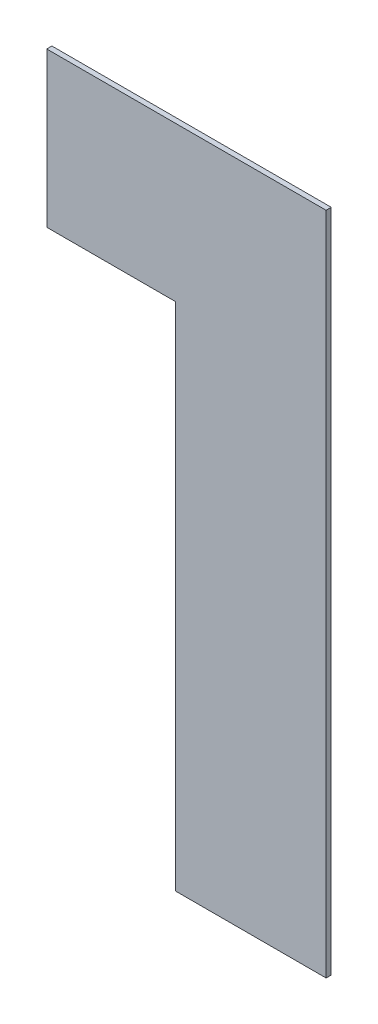
ISO-10303-21;
HEADER;
FILE_DESCRIPTION(('STEP AP214'),'2;1');
FILE_NAME('part.step','',(''),(''),'','','');
FILE_SCHEMA(('AUTOMOTIVE_DESIGN { 1 0 10303 214 1 1 1 1 }'));
ENDSEC;
DATA;
#1=APPLICATION_CONTEXT('core data for automotive mechanical design processes');
#2=APPLICATION_PROTOCOL_DEFINITION('international standard','automotive_design',2000,#1);
#3=PRODUCT_CONTEXT('',#1,'mechanical');
#4=PRODUCT('Part','Part','',(#3));
#5=PRODUCT_RELATED_PRODUCT_CATEGORY('part','',(#4));
#6=PRODUCT_DEFINITION_FORMATION('','',#4);
#7=PRODUCT_DEFINITION_CONTEXT('part definition',#1,'design');
#8=PRODUCT_DEFINITION('design','',#6,#7);
#9=PRODUCT_DEFINITION_SHAPE('','',#8);
#10=(LENGTH_UNIT() NAMED_UNIT(*) SI_UNIT(.MILLI.,.METRE.));
#11=(NAMED_UNIT(*) PLANE_ANGLE_UNIT() SI_UNIT($,.RADIAN.));
#12=(NAMED_UNIT(*) SI_UNIT($,.STERADIAN.) SOLID_ANGLE_UNIT());
#13=UNCERTAINTY_MEASURE_WITH_UNIT(LENGTH_MEASURE(1.E-05),#10,'distance_accuracy_value','');
#14=(GEOMETRIC_REPRESENTATION_CONTEXT(3) GLOBAL_UNCERTAINTY_ASSIGNED_CONTEXT((#13)) GLOBAL_UNIT_ASSIGNED_CONTEXT((#10,
#11,#12)) REPRESENTATION_CONTEXT('',''));
#15=CARTESIAN_POINT('',(0.,0.,0.));
#16=DIRECTION('',(0.,0.,1.));
#17=DIRECTION('',(1.,0.,0.));
#18=AXIS2_PLACEMENT_3D('',#15,#16,#17);
#19=CARTESIAN_POINT('',(1628.,0.,-30.));
#20=DIRECTION('',(0.,1.,0.));
#21=DIRECTION('',(-1.,0.,0.));
#22=AXIS2_PLACEMENT_3D('',#19,#20,#21);
#23=PLANE('',#22);
#24=DIRECTION('',(-1.,0.,0.));
#25=VECTOR('',#24,1.);
#26=CARTESIAN_POINT('',(1628.,0.,0.));
#27=LINE('',#26,#25);
#28=CARTESIAN_POINT('',(1628.,0.,0.));
#29=VERTEX_POINT('',#28);
#30=CARTESIAN_POINT('',(0.,0.,0.));
#31=VERTEX_POINT('',#30);
#32=EDGE_CURVE('E122',#29,#31,#27,.T.);
#33=ORIENTED_EDGE('',*,*,#32,.F.);
#34=DIRECTION('',(0.,0.,1.));
#35=VECTOR('',#34,1.);
#36=CARTESIAN_POINT('',(1628.,0.,-30.));
#37=LINE('',#36,#35);
#38=CARTESIAN_POINT('',(1628.,0.,-30.));
#39=VERTEX_POINT('',#38);
#40=EDGE_CURVE('E11',#39,#29,#37,.T.);
#41=ORIENTED_EDGE('',*,*,#40,.F.);
#42=DIRECTION('',(-1.,0.,0.));
#43=VECTOR('',#42,1.);
#44=CARTESIAN_POINT('',(1628.,0.,-30.));
#45=LINE('',#44,#43);
#46=CARTESIAN_POINT('',(0.,0.,-30.));
#47=VERTEX_POINT('',#46);
#48=EDGE_CURVE('E124',#39,#47,#45,.T.);
#49=ORIENTED_EDGE('',*,*,#48,.T.);
#50=DIRECTION('',(0.,0.,1.));
#51=VECTOR('',#50,1.);
#52=CARTESIAN_POINT('',(0.,0.,-30.));
#53=LINE('',#52,#51);
#54=EDGE_CURVE('E41',#47,#31,#53,.T.);
#55=ORIENTED_EDGE('',*,*,#54,.T.);
#56=EDGE_LOOP('',(#33,#41,#49,#55));
#57=FACE_BOUND('',#56,.T.);
#58=ADVANCED_FACE('F38',(#57),#23,.T.);
#59=CARTESIAN_POINT('',(1628.,-2874.,-30.));
#60=DIRECTION('',(1.,0.,0.));
#61=DIRECTION('',(0.,1.,0.));
#62=AXIS2_PLACEMENT_3D('',#59,#60,#61);
#63=PLANE('',#62);
#64=DIRECTION('',(0.,1.,0.));
#65=VECTOR('',#64,1.);
#66=CARTESIAN_POINT('',(1628.,-2874.,0.));
#67=LINE('',#66,#65);
#68=CARTESIAN_POINT('',(1628.,-3875.,0.));
#69=VERTEX_POINT('',#68);
#70=EDGE_CURVE('E127',#69,#29,#67,.T.);
#71=ORIENTED_EDGE('',*,*,#70,.F.);
#72=DIRECTION('',(0.,0.,1.));
#73=VECTOR('',#72,1.);
#74=CARTESIAN_POINT('',(1628.,-3875.,-30.));
#75=LINE('',#74,#73);
#76=CARTESIAN_POINT('',(1628.,-3875.,-30.));
#77=VERTEX_POINT('',#76);
#78=EDGE_CURVE('E115',#77,#69,#75,.T.);
#79=ORIENTED_EDGE('',*,*,#78,.F.);
#80=DIRECTION('',(0.,1.,0.));
#81=VECTOR('',#80,1.);
#82=CARTESIAN_POINT('',(1628.,-2874.,-30.));
#83=LINE('',#82,#81);
#84=EDGE_CURVE('E105',#77,#39,#83,.T.);
#85=ORIENTED_EDGE('',*,*,#84,.T.);
#86=ORIENTED_EDGE('',*,*,#40,.T.);
#87=EDGE_LOOP('',(#71,#79,#85,#86));
#88=FACE_BOUND('',#87,.T.);
#89=ADVANCED_FACE('F147',(#88),#63,.T.);
#90=CARTESIAN_POINT('',(750.,-900.,-30.));
#91=DIRECTION('',(-1.,0.,0.));
#92=DIRECTION('',(0.,-1.,0.));
#93=AXIS2_PLACEMENT_3D('',#90,#91,#92);
#94=PLANE('',#93);
#95=DIRECTION('',(0.,-1.,0.));
#96=VECTOR('',#95,1.);
#97=CARTESIAN_POINT('',(750.,-900.,0.));
#98=LINE('',#97,#96);
#99=CARTESIAN_POINT('',(750.,-900.,0.));
#100=VERTEX_POINT('',#99);
#101=CARTESIAN_POINT('',(750.,-3875.,0.));
#102=VERTEX_POINT('',#101);
#103=EDGE_CURVE('E139',#100,#102,#98,.T.);
#104=ORIENTED_EDGE('',*,*,#103,.F.);
#105=DIRECTION('',(0.,0.,1.));
#106=VECTOR('',#105,1.);
#107=CARTESIAN_POINT('',(750.,-900.,-30.));
#108=LINE('',#107,#106);
#109=CARTESIAN_POINT('',(750.,-900.,-30.));
#110=VERTEX_POINT('',#109);
#111=EDGE_CURVE('E47',#110,#100,#108,.T.);
#112=ORIENTED_EDGE('',*,*,#111,.F.);
#113=DIRECTION('',(0.,-1.,0.));
#114=VECTOR('',#113,1.);
#115=CARTESIAN_POINT('',(750.,-900.,-30.));
#116=LINE('',#115,#114);
#117=CARTESIAN_POINT('',(750.,-3875.,-30.));
#118=VERTEX_POINT('',#117);
#119=EDGE_CURVE('E97',#110,#118,#116,.T.);
#120=ORIENTED_EDGE('',*,*,#119,.T.);
#121=DIRECTION('',(0.,0.,1.));
#122=VECTOR('',#121,1.);
#123=CARTESIAN_POINT('',(750.,-3875.,-30.));
#124=LINE('',#123,#122);
#125=EDGE_CURVE('E100',#118,#102,#124,.T.);
#126=ORIENTED_EDGE('',*,*,#125,.T.);
#127=EDGE_LOOP('',(#104,#112,#120,#126));
#128=FACE_BOUND('',#127,.T.);
#129=ADVANCED_FACE('F99',(#128),#94,.T.);
#130=CARTESIAN_POINT('',(1.10218211923262E-13,-900.,-30.));
#131=DIRECTION('',(0.,-1.,0.));
#132=DIRECTION('',(0.,0.,-1.));
#133=AXIS2_PLACEMENT_3D('',#130,#131,#132);
#134=PLANE('',#133);
#135=DIRECTION('',(1.,0.,0.));
#136=VECTOR('',#135,1.);
#137=CARTESIAN_POINT('',(1.10218211923262E-13,-900.,0.));
#138=LINE('',#137,#136);
#139=CARTESIAN_POINT('',(1.10218211923262E-13,-900.,0.));
#140=VERTEX_POINT('',#139);
#141=EDGE_CURVE('E136',#140,#100,#138,.T.);
#142=ORIENTED_EDGE('',*,*,#141,.F.);
#143=DIRECTION('',(0.,0.,1.));
#144=VECTOR('',#143,1.);
#145=CARTESIAN_POINT('',(1.10218211923262E-13,-900.,-30.));
#146=LINE('',#145,#144);
#147=CARTESIAN_POINT('',(1.10218211923262E-13,-900.,-30.));
#148=VERTEX_POINT('',#147);
#149=EDGE_CURVE('E143',#148,#140,#146,.T.);
#150=ORIENTED_EDGE('',*,*,#149,.F.);
#151=DIRECTION('',(1.,0.,0.));
#152=VECTOR('',#151,1.);
#153=CARTESIAN_POINT('',(1.10218211923262E-13,-900.,-30.));
#154=LINE('',#153,#152);
#155=EDGE_CURVE('E106',#148,#110,#154,.T.);
#156=ORIENTED_EDGE('',*,*,#155,.T.);
#157=ORIENTED_EDGE('',*,*,#111,.T.);
#158=EDGE_LOOP('',(#142,#150,#156,#157));
#159=FACE_BOUND('',#158,.T.);
#160=ADVANCED_FACE('F154',(#159),#134,.T.);
#161=CARTESIAN_POINT('',(0.,0.,-30.));
#162=DIRECTION('',(-1.,0.,0.));
#163=DIRECTION('',(0.,-1.,0.));
#164=AXIS2_PLACEMENT_3D('',#161,#162,#163);
#165=PLANE('',#164);
#166=DIRECTION('',(0.,-1.,0.));
#167=VECTOR('',#166,1.);
#168=CARTESIAN_POINT('',(0.,0.,0.));
#169=LINE('',#168,#167);
#170=EDGE_CURVE('E133',#31,#140,#169,.T.);
#171=ORIENTED_EDGE('',*,*,#170,.F.);
#172=ORIENTED_EDGE('',*,*,#54,.F.);
#173=DIRECTION('',(0.,-1.,0.));
#174=VECTOR('',#173,1.);
#175=CARTESIAN_POINT('',(0.,0.,-30.));
#176=LINE('',#175,#174);
#177=EDGE_CURVE('E126',#47,#148,#176,.T.);
#178=ORIENTED_EDGE('',*,*,#177,.T.);
#179=ORIENTED_EDGE('',*,*,#149,.T.);
#180=EDGE_LOOP('',(#171,#172,#178,#179));
#181=FACE_BOUND('',#180,.T.);
#182=ADVANCED_FACE('F144',(#181),#165,.T.);
#183=CARTESIAN_POINT('',(0.,0.,-30.));
#184=DIRECTION('',(0.,0.,1.));
#185=DIRECTION('',(1.,0.,0.));
#186=AXIS2_PLACEMENT_3D('',#183,#184,#185);
#187=PLANE('',#186);
#188=ORIENTED_EDGE('',*,*,#48,.F.);
#189=ORIENTED_EDGE('',*,*,#84,.F.);
#190=DIRECTION('',(1.,0.,0.));
#191=VECTOR('',#190,1.);
#192=CARTESIAN_POINT('',(1628.,-3875.,-30.));
#193=LINE('',#192,#191);
#194=EDGE_CURVE('E112',#118,#77,#193,.T.);
#195=ORIENTED_EDGE('',*,*,#194,.F.);
#196=ORIENTED_EDGE('',*,*,#119,.F.);
#197=ORIENTED_EDGE('',*,*,#155,.F.);
#198=ORIENTED_EDGE('',*,*,#177,.F.);
#199=EDGE_LOOP('',(#188,#189,#195,#196,#197,#198));
#200=FACE_BOUND('',#199,.T.);
#201=ADVANCED_FACE('F117',(#200),#187,.F.);
#202=CARTESIAN_POINT('',(0.,0.,0.));
#203=DIRECTION('',(0.,0.,1.));
#204=DIRECTION('',(1.,0.,0.));
#205=AXIS2_PLACEMENT_3D('',#202,#203,#204);
#206=PLANE('',#205);
#207=ORIENTED_EDGE('',*,*,#32,.T.);
#208=ORIENTED_EDGE('',*,*,#170,.T.);
#209=ORIENTED_EDGE('',*,*,#141,.T.);
#210=ORIENTED_EDGE('',*,*,#103,.T.);
#211=DIRECTION('',(1.,0.,0.));
#212=VECTOR('',#211,1.);
#213=CARTESIAN_POINT('',(1628.,-3875.,0.));
#214=LINE('',#213,#212);
#215=EDGE_CURVE('E114',#102,#69,#214,.T.);
#216=ORIENTED_EDGE('',*,*,#215,.T.);
#217=ORIENTED_EDGE('',*,*,#70,.T.);
#218=EDGE_LOOP('',(#207,#208,#209,#210,#216,#217));
#219=FACE_BOUND('',#218,.T.);
#220=ADVANCED_FACE('F146',(#219),#206,.T.);
#221=CARTESIAN_POINT('',(1628.,-3875.,-30.));
#222=DIRECTION('',(0.,-1.,0.));
#223=DIRECTION('',(0.,0.,-1.));
#224=AXIS2_PLACEMENT_3D('',#221,#222,#223);
#225=PLANE('',#224);
#226=ORIENTED_EDGE('',*,*,#215,.F.);
#227=ORIENTED_EDGE('',*,*,#125,.F.);
#228=ORIENTED_EDGE('',*,*,#194,.T.);
#229=ORIENTED_EDGE('',*,*,#78,.T.);
#230=EDGE_LOOP('',(#226,#227,#228,#229));
#231=FACE_BOUND('',#230,.T.);
#232=ADVANCED_FACE('F110',(#231),#225,.T.);
#233=CLOSED_SHELL('',(#58,#89,#129,#160,#182,#201,#220,#232));
#234=MANIFOLD_SOLID_BREP('B2',#233);
#235=ADVANCED_BREP_SHAPE_REPRESENTATION('',(#18,#234),#14);
#236=SHAPE_DEFINITION_REPRESENTATION(#9,#235);
ENDSEC;
END-ISO-10303-21;
